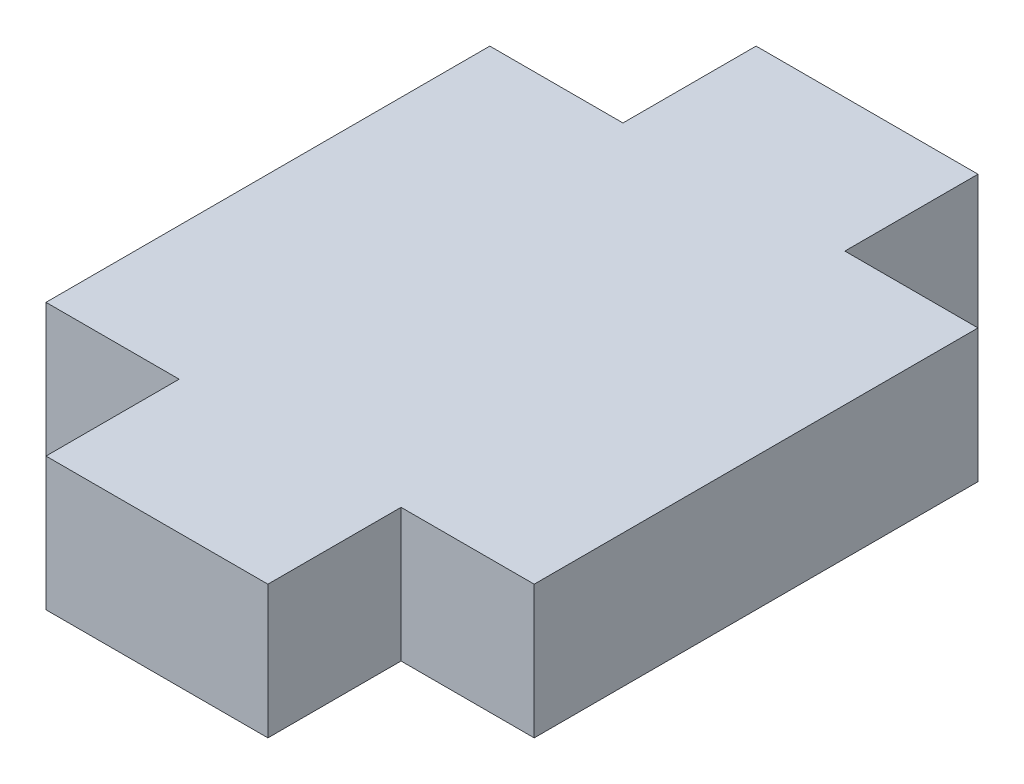
ISO-10303-21;
HEADER;
FILE_DESCRIPTION(('STEP AP214'),'2;1');
FILE_NAME('part.step','',(''),(''),'','','');
FILE_SCHEMA(('AUTOMOTIVE_DESIGN { 1 0 10303 214 1 1 1 1 }'));
ENDSEC;
DATA;
#1=APPLICATION_CONTEXT('core data for automotive mechanical design processes');
#2=APPLICATION_PROTOCOL_DEFINITION('international standard','automotive_design',2000,#1);
#3=PRODUCT_CONTEXT('',#1,'mechanical');
#4=PRODUCT('Part','Part','',(#3));
#5=PRODUCT_RELATED_PRODUCT_CATEGORY('part','',(#4));
#6=PRODUCT_DEFINITION_FORMATION('','',#4);
#7=PRODUCT_DEFINITION_CONTEXT('part definition',#1,'design');
#8=PRODUCT_DEFINITION('design','',#6,#7);
#9=PRODUCT_DEFINITION_SHAPE('','',#8);
#10=(LENGTH_UNIT() NAMED_UNIT(*) SI_UNIT(.MILLI.,.METRE.));
#11=(NAMED_UNIT(*) PLANE_ANGLE_UNIT() SI_UNIT($,.RADIAN.));
#12=(NAMED_UNIT(*) SI_UNIT($,.STERADIAN.) SOLID_ANGLE_UNIT());
#13=UNCERTAINTY_MEASURE_WITH_UNIT(LENGTH_MEASURE(1.E-05),#10,'distance_accuracy_value','');
#14=(GEOMETRIC_REPRESENTATION_CONTEXT(3) GLOBAL_UNCERTAINTY_ASSIGNED_CONTEXT((#13)) GLOBAL_UNIT_ASSIGNED_CONTEXT((#10,
#11,#12)) REPRESENTATION_CONTEXT('',''));
#15=CARTESIAN_POINT('',(0.,0.,0.));
#16=DIRECTION('',(0.,0.,1.));
#17=DIRECTION('',(1.,0.,0.));
#18=AXIS2_PLACEMENT_3D('',#15,#16,#17);
#19=CARTESIAN_POINT('',(-2.5,1.5,-5.));
#20=DIRECTION('',(0.,0.,1.));
#21=DIRECTION('',(1.,0.,0.));
#22=AXIS2_PLACEMENT_3D('',#19,#20,#21);
#23=PLANE('',#22);
#24=DIRECTION('',(-1.,0.,0.));
#25=VECTOR('',#24,1.);
#26=CARTESIAN_POINT('',(-2.5,-1.5,-5.));
#27=LINE('',#26,#25);
#28=CARTESIAN_POINT('',(-2.5,-1.5,-5.));
#29=VERTEX_POINT('',#28);
#30=CARTESIAN_POINT('',(-5.5,-1.5,-5.));
#31=VERTEX_POINT('',#30);
#32=EDGE_CURVE('E158',#29,#31,#27,.T.);
#33=ORIENTED_EDGE('',*,*,#32,.T.);
#34=DIRECTION('',(0.,-1.,0.));
#35=VECTOR('',#34,1.);
#36=CARTESIAN_POINT('',(-5.5,1.5,-5.));
#37=LINE('',#36,#35);
#38=CARTESIAN_POINT('',(-5.5,1.5,-5.));
#39=VERTEX_POINT('',#38);
#40=EDGE_CURVE('E11',#39,#31,#37,.T.);
#41=ORIENTED_EDGE('',*,*,#40,.F.);
#42=DIRECTION('',(-1.,0.,0.));
#43=VECTOR('',#42,1.);
#44=CARTESIAN_POINT('',(-2.5,1.5,-5.));
#45=LINE('',#44,#43);
#46=CARTESIAN_POINT('',(-2.5,1.5,-5.));
#47=VERTEX_POINT('',#46);
#48=EDGE_CURVE('E180',#47,#39,#45,.T.);
#49=ORIENTED_EDGE('',*,*,#48,.F.);
#50=DIRECTION('',(0.,-1.,0.));
#51=VECTOR('',#50,1.);
#52=CARTESIAN_POINT('',(-2.5,1.5,-5.));
#53=LINE('',#52,#51);
#54=EDGE_CURVE('E154',#47,#29,#53,.T.);
#55=ORIENTED_EDGE('',*,*,#54,.T.);
#56=EDGE_LOOP('',(#33,#41,#49,#55));
#57=FACE_BOUND('',#56,.T.);
#58=ADVANCED_FACE('F38',(#57),#23,.F.);
#59=CARTESIAN_POINT('',(-5.5,1.5,-5.));
#60=DIRECTION('',(1.,0.,0.));
#61=DIRECTION('',(0.,0.,-1.));
#62=AXIS2_PLACEMENT_3D('',#59,#60,#61);
#63=PLANE('',#62);
#64=DIRECTION('',(0.,0.,1.));
#65=VECTOR('',#64,1.);
#66=CARTESIAN_POINT('',(-5.5,-1.5,-5.));
#67=LINE('',#66,#65);
#68=CARTESIAN_POINT('',(-5.5,-1.5,5.));
#69=VERTEX_POINT('',#68);
#70=EDGE_CURVE('E161',#31,#69,#67,.T.);
#71=ORIENTED_EDGE('',*,*,#70,.T.);
#72=DIRECTION('',(0.,-1.,0.));
#73=VECTOR('',#72,1.);
#74=CARTESIAN_POINT('',(-5.5,1.5,5.));
#75=LINE('',#74,#73);
#76=CARTESIAN_POINT('',(-5.5,1.5,5.));
#77=VERTEX_POINT('',#76);
#78=EDGE_CURVE('E46',#77,#69,#75,.T.);
#79=ORIENTED_EDGE('',*,*,#78,.F.);
#80=DIRECTION('',(0.,0.,1.));
#81=VECTOR('',#80,1.);
#82=CARTESIAN_POINT('',(-5.5,1.5,-5.));
#83=LINE('',#82,#81);
#84=EDGE_CURVE('E109',#39,#77,#83,.T.);
#85=ORIENTED_EDGE('',*,*,#84,.F.);
#86=ORIENTED_EDGE('',*,*,#40,.T.);
#87=EDGE_LOOP('',(#71,#79,#85,#86));
#88=FACE_BOUND('',#87,.T.);
#89=ADVANCED_FACE('F258',(#88),#63,.F.);
#90=CARTESIAN_POINT('',(-5.5,1.5,5.));
#91=DIRECTION('',(0.,0.,-1.));
#92=DIRECTION('',(-1.,0.,0.));
#93=AXIS2_PLACEMENT_3D('',#90,#91,#92);
#94=PLANE('',#93);
#95=DIRECTION('',(1.,0.,0.));
#96=VECTOR('',#95,1.);
#97=CARTESIAN_POINT('',(-5.5,-1.5,5.));
#98=LINE('',#97,#96);
#99=CARTESIAN_POINT('',(-2.5,-1.5,5.));
#100=VERTEX_POINT('',#99);
#101=EDGE_CURVE('E163',#69,#100,#98,.T.);
#102=ORIENTED_EDGE('',*,*,#101,.T.);
#103=DIRECTION('',(0.,-1.,0.));
#104=VECTOR('',#103,1.);
#105=CARTESIAN_POINT('',(-2.5,1.5,5.));
#106=LINE('',#105,#104);
#107=CARTESIAN_POINT('',(-2.5,1.5,5.));
#108=VERTEX_POINT('',#107);
#109=EDGE_CURVE('E199',#108,#100,#106,.T.);
#110=ORIENTED_EDGE('',*,*,#109,.F.);
#111=DIRECTION('',(1.,0.,0.));
#112=VECTOR('',#111,1.);
#113=CARTESIAN_POINT('',(-5.5,1.5,5.));
#114=LINE('',#113,#112);
#115=EDGE_CURVE('E207',#77,#108,#114,.T.);
#116=ORIENTED_EDGE('',*,*,#115,.F.);
#117=ORIENTED_EDGE('',*,*,#78,.T.);
#118=EDGE_LOOP('',(#102,#110,#116,#117));
#119=FACE_BOUND('',#118,.T.);
#120=ADVANCED_FACE('F205',(#119),#94,.F.);
#121=CARTESIAN_POINT('',(-2.5,1.5,5.));
#122=DIRECTION('',(1.,0.,0.));
#123=DIRECTION('',(0.,0.,-1.));
#124=AXIS2_PLACEMENT_3D('',#121,#122,#123);
#125=PLANE('',#124);
#126=DIRECTION('',(0.,0.,1.));
#127=VECTOR('',#126,1.);
#128=CARTESIAN_POINT('',(-2.5,-1.5,5.));
#129=LINE('',#128,#127);
#130=CARTESIAN_POINT('',(-2.5,-1.5,8.));
#131=VERTEX_POINT('',#130);
#132=EDGE_CURVE('E165',#100,#131,#129,.T.);
#133=ORIENTED_EDGE('',*,*,#132,.T.);
#134=DIRECTION('',(0.,-1.,0.));
#135=VECTOR('',#134,1.);
#136=CARTESIAN_POINT('',(-2.5,1.5,8.));
#137=LINE('',#136,#135);
#138=CARTESIAN_POINT('',(-2.5,1.5,8.));
#139=VERTEX_POINT('',#138);
#140=EDGE_CURVE('E196',#139,#131,#137,.T.);
#141=ORIENTED_EDGE('',*,*,#140,.F.);
#142=DIRECTION('',(0.,0.,1.));
#143=VECTOR('',#142,1.);
#144=CARTESIAN_POINT('',(-2.5,1.5,5.));
#145=LINE('',#144,#143);
#146=EDGE_CURVE('E225',#108,#139,#145,.T.);
#147=ORIENTED_EDGE('',*,*,#146,.F.);
#148=ORIENTED_EDGE('',*,*,#109,.T.);
#149=EDGE_LOOP('',(#133,#141,#147,#148));
#150=FACE_BOUND('',#149,.T.);
#151=ADVANCED_FACE('F216',(#150),#125,.F.);
#152=CARTESIAN_POINT('',(-2.5,1.5,8.));
#153=DIRECTION('',(0.,0.,-1.));
#154=DIRECTION('',(-1.,0.,0.));
#155=AXIS2_PLACEMENT_3D('',#152,#153,#154);
#156=PLANE('',#155);
#157=DIRECTION('',(1.,0.,0.));
#158=VECTOR('',#157,1.);
#159=CARTESIAN_POINT('',(-2.5,-1.5,8.));
#160=LINE('',#159,#158);
#161=CARTESIAN_POINT('',(2.5,-1.5,8.));
#162=VERTEX_POINT('',#161);
#163=EDGE_CURVE('E167',#131,#162,#160,.T.);
#164=ORIENTED_EDGE('',*,*,#163,.T.);
#165=DIRECTION('',(0.,-1.,0.));
#166=VECTOR('',#165,1.);
#167=CARTESIAN_POINT('',(2.5,1.5,8.));
#168=LINE('',#167,#166);
#169=CARTESIAN_POINT('',(2.5,1.5,8.));
#170=VERTEX_POINT('',#169);
#171=EDGE_CURVE('E193',#170,#162,#168,.T.);
#172=ORIENTED_EDGE('',*,*,#171,.F.);
#173=DIRECTION('',(1.,0.,0.));
#174=VECTOR('',#173,1.);
#175=CARTESIAN_POINT('',(-2.5,1.5,8.));
#176=LINE('',#175,#174);
#177=EDGE_CURVE('E222',#139,#170,#176,.T.);
#178=ORIENTED_EDGE('',*,*,#177,.F.);
#179=ORIENTED_EDGE('',*,*,#140,.T.);
#180=EDGE_LOOP('',(#164,#172,#178,#179));
#181=FACE_BOUND('',#180,.T.);
#182=ADVANCED_FACE('F220',(#181),#156,.F.);
#183=CARTESIAN_POINT('',(2.5,1.5,8.));
#184=DIRECTION('',(-1.,0.,0.));
#185=DIRECTION('',(0.,0.,1.));
#186=AXIS2_PLACEMENT_3D('',#183,#184,#185);
#187=PLANE('',#186);
#188=DIRECTION('',(0.,0.,-1.));
#189=VECTOR('',#188,1.);
#190=CARTESIAN_POINT('',(2.5,-1.5,8.));
#191=LINE('',#190,#189);
#192=CARTESIAN_POINT('',(2.5,-1.5,5.));
#193=VERTEX_POINT('',#192);
#194=EDGE_CURVE('E169',#162,#193,#191,.T.);
#195=ORIENTED_EDGE('',*,*,#194,.T.);
#196=DIRECTION('',(0.,-1.,0.));
#197=VECTOR('',#196,1.);
#198=CARTESIAN_POINT('',(2.5,1.5,5.));
#199=LINE('',#198,#197);
#200=CARTESIAN_POINT('',(2.5,1.5,5.));
#201=VERTEX_POINT('',#200);
#202=EDGE_CURVE('E190',#201,#193,#199,.T.);
#203=ORIENTED_EDGE('',*,*,#202,.F.);
#204=DIRECTION('',(0.,0.,-1.));
#205=VECTOR('',#204,1.);
#206=CARTESIAN_POINT('',(2.5,1.5,8.));
#207=LINE('',#206,#205);
#208=EDGE_CURVE('E224',#170,#201,#207,.T.);
#209=ORIENTED_EDGE('',*,*,#208,.F.);
#210=ORIENTED_EDGE('',*,*,#171,.T.);
#211=EDGE_LOOP('',(#195,#203,#209,#210));
#212=FACE_BOUND('',#211,.T.);
#213=ADVANCED_FACE('F271',(#212),#187,.F.);
#214=CARTESIAN_POINT('',(2.5,1.5,5.));
#215=DIRECTION('',(0.,0.,-1.));
#216=DIRECTION('',(-1.,0.,0.));
#217=AXIS2_PLACEMENT_3D('',#214,#215,#216);
#218=PLANE('',#217);
#219=DIRECTION('',(1.,0.,0.));
#220=VECTOR('',#219,1.);
#221=CARTESIAN_POINT('',(2.5,-1.5,5.));
#222=LINE('',#221,#220);
#223=CARTESIAN_POINT('',(5.5,-1.5,5.));
#224=VERTEX_POINT('',#223);
#225=EDGE_CURVE('E171',#193,#224,#222,.T.);
#226=ORIENTED_EDGE('',*,*,#225,.T.);
#227=DIRECTION('',(0.,-1.,0.));
#228=VECTOR('',#227,1.);
#229=CARTESIAN_POINT('',(5.5,1.5,5.));
#230=LINE('',#229,#228);
#231=CARTESIAN_POINT('',(5.5,1.5,5.));
#232=VERTEX_POINT('',#231);
#233=EDGE_CURVE('E187',#232,#224,#230,.T.);
#234=ORIENTED_EDGE('',*,*,#233,.F.);
#235=DIRECTION('',(1.,0.,0.));
#236=VECTOR('',#235,1.);
#237=CARTESIAN_POINT('',(2.5,1.5,5.));
#238=LINE('',#237,#236);
#239=EDGE_CURVE('E227',#201,#232,#238,.T.);
#240=ORIENTED_EDGE('',*,*,#239,.F.);
#241=ORIENTED_EDGE('',*,*,#202,.T.);
#242=EDGE_LOOP('',(#226,#234,#240,#241));
#243=FACE_BOUND('',#242,.T.);
#244=ADVANCED_FACE('F274',(#243),#218,.F.);
#245=CARTESIAN_POINT('',(5.5,1.5,5.));
#246=DIRECTION('',(-1.,0.,0.));
#247=DIRECTION('',(0.,0.,1.));
#248=AXIS2_PLACEMENT_3D('',#245,#246,#247);
#249=PLANE('',#248);
#250=DIRECTION('',(0.,0.,-1.));
#251=VECTOR('',#250,1.);
#252=CARTESIAN_POINT('',(5.5,-1.5,5.));
#253=LINE('',#252,#251);
#254=CARTESIAN_POINT('',(5.5,-1.5,-5.));
#255=VERTEX_POINT('',#254);
#256=EDGE_CURVE('E173',#224,#255,#253,.T.);
#257=ORIENTED_EDGE('',*,*,#256,.T.);
#258=DIRECTION('',(0.,-1.,0.));
#259=VECTOR('',#258,1.);
#260=CARTESIAN_POINT('',(5.5,1.5,-5.));
#261=LINE('',#260,#259);
#262=CARTESIAN_POINT('',(5.5,1.5,-5.));
#263=VERTEX_POINT('',#262);
#264=EDGE_CURVE('E184',#263,#255,#261,.T.);
#265=ORIENTED_EDGE('',*,*,#264,.F.);
#266=DIRECTION('',(0.,0.,-1.));
#267=VECTOR('',#266,1.);
#268=CARTESIAN_POINT('',(5.5,1.5,5.));
#269=LINE('',#268,#267);
#270=EDGE_CURVE('E233',#232,#263,#269,.T.);
#271=ORIENTED_EDGE('',*,*,#270,.F.);
#272=ORIENTED_EDGE('',*,*,#233,.T.);
#273=EDGE_LOOP('',(#257,#265,#271,#272));
#274=FACE_BOUND('',#273,.T.);
#275=ADVANCED_FACE('F239',(#274),#249,.F.);
#276=CARTESIAN_POINT('',(5.5,1.5,-5.));
#277=DIRECTION('',(0.,0.,1.));
#278=DIRECTION('',(1.,0.,0.));
#279=AXIS2_PLACEMENT_3D('',#276,#277,#278);
#280=PLANE('',#279);
#281=DIRECTION('',(-1.,0.,0.));
#282=VECTOR('',#281,1.);
#283=CARTESIAN_POINT('',(5.5,-1.5,-5.));
#284=LINE('',#283,#282);
#285=CARTESIAN_POINT('',(2.5,-1.5,-5.));
#286=VERTEX_POINT('',#285);
#287=EDGE_CURVE('E175',#255,#286,#284,.T.);
#288=ORIENTED_EDGE('',*,*,#287,.T.);
#289=DIRECTION('',(0.,-1.,0.));
#290=VECTOR('',#289,1.);
#291=CARTESIAN_POINT('',(2.5,1.5,-5.));
#292=LINE('',#291,#290);
#293=CARTESIAN_POINT('',(2.5,1.5,-5.));
#294=VERTEX_POINT('',#293);
#295=EDGE_CURVE('E149',#294,#286,#292,.T.);
#296=ORIENTED_EDGE('',*,*,#295,.F.);
#297=DIRECTION('',(-1.,0.,0.));
#298=VECTOR('',#297,1.);
#299=CARTESIAN_POINT('',(5.5,1.5,-5.));
#300=LINE('',#299,#298);
#301=EDGE_CURVE('E140',#263,#294,#300,.T.);
#302=ORIENTED_EDGE('',*,*,#301,.F.);
#303=ORIENTED_EDGE('',*,*,#264,.T.);
#304=EDGE_LOOP('',(#288,#296,#302,#303));
#305=FACE_BOUND('',#304,.T.);
#306=ADVANCED_FACE('F243',(#305),#280,.F.);
#307=CARTESIAN_POINT('',(2.5,1.5,-5.));
#308=DIRECTION('',(-1.,0.,0.));
#309=DIRECTION('',(0.,0.,1.));
#310=AXIS2_PLACEMENT_3D('',#307,#308,#309);
#311=PLANE('',#310);
#312=DIRECTION('',(0.,0.,-1.));
#313=VECTOR('',#312,1.);
#314=CARTESIAN_POINT('',(2.5,-1.5,-5.));
#315=LINE('',#314,#313);
#316=CARTESIAN_POINT('',(2.5,-1.5,-8.));
#317=VERTEX_POINT('',#316);
#318=EDGE_CURVE('E148',#286,#317,#315,.T.);
#319=ORIENTED_EDGE('',*,*,#318,.T.);
#320=DIRECTION('',(0.,-1.,0.));
#321=VECTOR('',#320,1.);
#322=CARTESIAN_POINT('',(2.5,1.5,-8.));
#323=LINE('',#322,#321);
#324=CARTESIAN_POINT('',(2.5,1.5,-8.));
#325=VERTEX_POINT('',#324);
#326=EDGE_CURVE('E145',#325,#317,#323,.T.);
#327=ORIENTED_EDGE('',*,*,#326,.F.);
#328=DIRECTION('',(0.,0.,-1.));
#329=VECTOR('',#328,1.);
#330=CARTESIAN_POINT('',(2.5,1.5,-5.));
#331=LINE('',#330,#329);
#332=EDGE_CURVE('E134',#294,#325,#331,.T.);
#333=ORIENTED_EDGE('',*,*,#332,.F.);
#334=ORIENTED_EDGE('',*,*,#295,.T.);
#335=EDGE_LOOP('',(#319,#327,#333,#334));
#336=FACE_BOUND('',#335,.T.);
#337=ADVANCED_FACE('F146',(#336),#311,.F.);
#338=CARTESIAN_POINT('',(2.5,1.5,-8.));
#339=DIRECTION('',(0.,0.,1.));
#340=DIRECTION('',(1.,0.,0.));
#341=AXIS2_PLACEMENT_3D('',#338,#339,#340);
#342=PLANE('',#341);
#343=DIRECTION('',(-1.,0.,0.));
#344=VECTOR('',#343,1.);
#345=CARTESIAN_POINT('',(2.5,-1.5,-8.));
#346=LINE('',#345,#344);
#347=CARTESIAN_POINT('',(-2.5,-1.5,-8.));
#348=VERTEX_POINT('',#347);
#349=EDGE_CURVE('E95',#317,#348,#346,.T.);
#350=ORIENTED_EDGE('',*,*,#349,.T.);
#351=DIRECTION('',(0.,-1.,0.));
#352=VECTOR('',#351,1.);
#353=CARTESIAN_POINT('',(-2.5,1.5,-8.));
#354=LINE('',#353,#352);
#355=CARTESIAN_POINT('',(-2.5,1.5,-8.));
#356=VERTEX_POINT('',#355);
#357=EDGE_CURVE('E150',#356,#348,#354,.T.);
#358=ORIENTED_EDGE('',*,*,#357,.F.);
#359=DIRECTION('',(-1.,0.,0.));
#360=VECTOR('',#359,1.);
#361=CARTESIAN_POINT('',(2.5,1.5,-8.));
#362=LINE('',#361,#360);
#363=EDGE_CURVE('E138',#325,#356,#362,.T.);
#364=ORIENTED_EDGE('',*,*,#363,.F.);
#365=ORIENTED_EDGE('',*,*,#326,.T.);
#366=EDGE_LOOP('',(#350,#358,#364,#365));
#367=FACE_BOUND('',#366,.T.);
#368=ADVANCED_FACE('F152',(#367),#342,.F.);
#369=CARTESIAN_POINT('',(-2.5,1.5,-8.));
#370=DIRECTION('',(1.,0.,0.));
#371=DIRECTION('',(0.,0.,-1.));
#372=AXIS2_PLACEMENT_3D('',#369,#370,#371);
#373=PLANE('',#372);
#374=DIRECTION('',(0.,0.,1.));
#375=VECTOR('',#374,1.);
#376=CARTESIAN_POINT('',(-2.5,-1.5,-8.));
#377=LINE('',#376,#375);
#378=EDGE_CURVE('E101',#348,#29,#377,.T.);
#379=ORIENTED_EDGE('',*,*,#378,.T.);
#380=ORIENTED_EDGE('',*,*,#54,.F.);
#381=DIRECTION('',(0.,0.,1.));
#382=VECTOR('',#381,1.);
#383=CARTESIAN_POINT('',(-2.5,1.5,-8.));
#384=LINE('',#383,#382);
#385=EDGE_CURVE('E54',#356,#47,#384,.T.);
#386=ORIENTED_EDGE('',*,*,#385,.F.);
#387=ORIENTED_EDGE('',*,*,#357,.T.);
#388=EDGE_LOOP('',(#379,#380,#386,#387));
#389=FACE_BOUND('',#388,.T.);
#390=ADVANCED_FACE('F247',(#389),#373,.F.);
#391=CARTESIAN_POINT('',(0.,1.5,0.));
#392=DIRECTION('',(0.,1.,0.));
#393=DIRECTION('',(0.,0.,1.));
#394=AXIS2_PLACEMENT_3D('',#391,#392,#393);
#395=PLANE('',#394);
#396=ORIENTED_EDGE('',*,*,#48,.T.);
#397=ORIENTED_EDGE('',*,*,#84,.T.);
#398=ORIENTED_EDGE('',*,*,#115,.T.);
#399=ORIENTED_EDGE('',*,*,#146,.T.);
#400=ORIENTED_EDGE('',*,*,#177,.T.);
#401=ORIENTED_EDGE('',*,*,#208,.T.);
#402=ORIENTED_EDGE('',*,*,#239,.T.);
#403=ORIENTED_EDGE('',*,*,#270,.T.);
#404=ORIENTED_EDGE('',*,*,#301,.T.);
#405=ORIENTED_EDGE('',*,*,#332,.T.);
#406=ORIENTED_EDGE('',*,*,#363,.T.);
#407=ORIENTED_EDGE('',*,*,#385,.T.);
#408=EDGE_LOOP('',(#396,#397,#398,#399,#400,#401,#402,#403,#404,#405,#406,#407));
#409=FACE_BOUND('',#408,.T.);
#410=ADVANCED_FACE('F136',(#409),#395,.T.);
#411=CARTESIAN_POINT('',(0.,-1.5,0.));
#412=DIRECTION('',(0.,1.,0.));
#413=DIRECTION('',(0.,0.,1.));
#414=AXIS2_PLACEMENT_3D('',#411,#412,#413);
#415=PLANE('',#414);
#416=ORIENTED_EDGE('',*,*,#32,.F.);
#417=ORIENTED_EDGE('',*,*,#378,.F.);
#418=ORIENTED_EDGE('',*,*,#349,.F.);
#419=ORIENTED_EDGE('',*,*,#318,.F.);
#420=ORIENTED_EDGE('',*,*,#287,.F.);
#421=ORIENTED_EDGE('',*,*,#256,.F.);
#422=ORIENTED_EDGE('',*,*,#225,.F.);
#423=ORIENTED_EDGE('',*,*,#194,.F.);
#424=ORIENTED_EDGE('',*,*,#163,.F.);
#425=ORIENTED_EDGE('',*,*,#132,.F.);
#426=ORIENTED_EDGE('',*,*,#101,.F.);
#427=ORIENTED_EDGE('',*,*,#70,.F.);
#428=EDGE_LOOP('',(#416,#417,#418,#419,#420,#421,#422,#423,#424,#425,#426,#427));
#429=FACE_BOUND('',#428,.T.);
#430=ADVANCED_FACE('F211',(#429),#415,.F.);
#431=CLOSED_SHELL('',(#58,#89,#120,#151,#182,#213,#244,#275,#306,#337,#368,#390,#410,#430));
#432=MANIFOLD_SOLID_BREP('B2',#431);
#433=ADVANCED_BREP_SHAPE_REPRESENTATION('',(#18,#432),#14);
#434=SHAPE_DEFINITION_REPRESENTATION(#9,#433);
ENDSEC;
END-ISO-10303-21;
